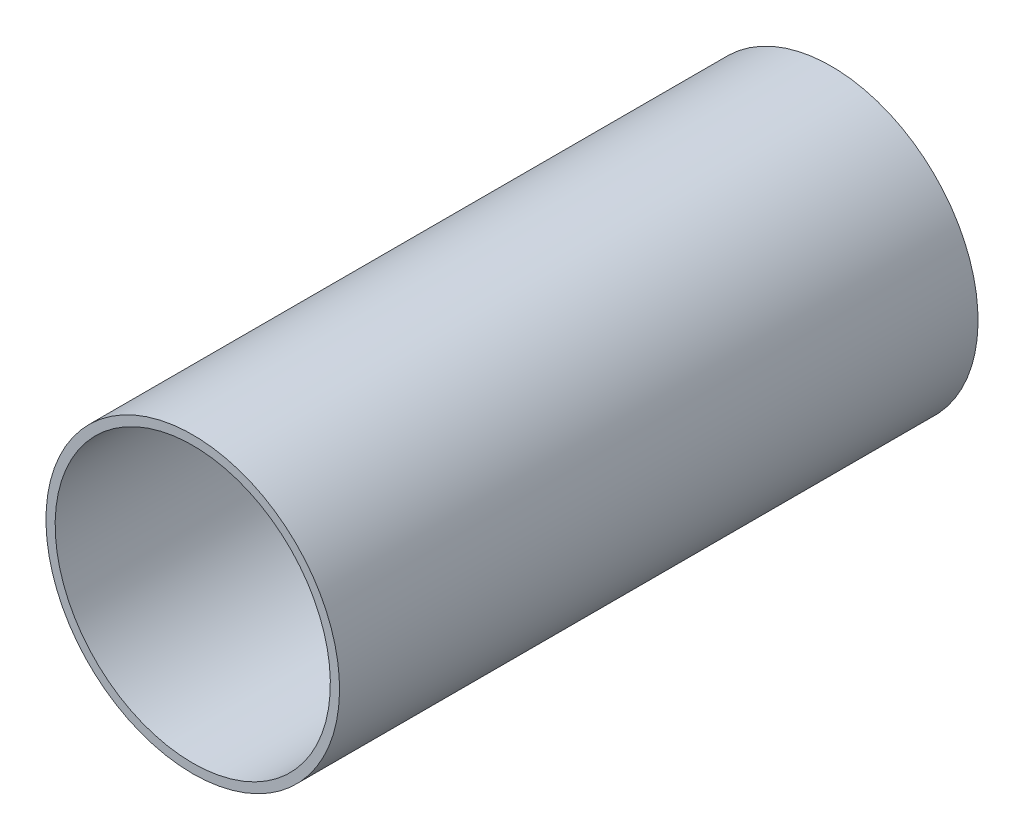
ISO-10303-21;
HEADER;
FILE_DESCRIPTION(('STEP AP214'),'2;1');
FILE_NAME('part.step','',(''),(''),'','','');
FILE_SCHEMA(('AUTOMOTIVE_DESIGN { 1 0 10303 214 1 1 1 1 }'));
ENDSEC;
DATA;
#1=APPLICATION_CONTEXT('core data for automotive mechanical design processes');
#2=APPLICATION_PROTOCOL_DEFINITION('international standard','automotive_design',2000,#1);
#3=PRODUCT_CONTEXT('',#1,'mechanical');
#4=PRODUCT('Part','Part','',(#3));
#5=PRODUCT_RELATED_PRODUCT_CATEGORY('part','',(#4));
#6=PRODUCT_DEFINITION_FORMATION('','',#4);
#7=PRODUCT_DEFINITION_CONTEXT('part definition',#1,'design');
#8=PRODUCT_DEFINITION('design','',#6,#7);
#9=PRODUCT_DEFINITION_SHAPE('','',#8);
#10=(LENGTH_UNIT() NAMED_UNIT(*) SI_UNIT(.MILLI.,.METRE.));
#11=(NAMED_UNIT(*) PLANE_ANGLE_UNIT() SI_UNIT($,.RADIAN.));
#12=(NAMED_UNIT(*) SI_UNIT($,.STERADIAN.) SOLID_ANGLE_UNIT());
#13=UNCERTAINTY_MEASURE_WITH_UNIT(LENGTH_MEASURE(1.E-05),#10,'distance_accuracy_value','');
#14=(GEOMETRIC_REPRESENTATION_CONTEXT(3) GLOBAL_UNCERTAINTY_ASSIGNED_CONTEXT((#13)) GLOBAL_UNIT_ASSIGNED_CONTEXT((#10,
#11,#12)) REPRESENTATION_CONTEXT('',''));
#15=CARTESIAN_POINT('',(0.,0.,0.));
#16=DIRECTION('',(0.,0.,1.));
#17=DIRECTION('',(1.,0.,0.));
#18=AXIS2_PLACEMENT_3D('',#15,#16,#17);
#19=CARTESIAN_POINT('',(170.18,-110.236,-0.045));
#20=DIRECTION('',(0.,0.,-1.));
#21=DIRECTION('',(0.,-1.,0.));
#22=AXIS2_PLACEMENT_3D('',#19,#20,#21);
#23=CYLINDRICAL_SURFACE('',#22,0.375);
#24=CARTESIAN_POINT('',(170.18,-110.236,-0.035));
#25=DIRECTION('',(0.,0.,-1.));
#26=DIRECTION('',(0.,-1.,0.));
#27=AXIS2_PLACEMENT_3D('',#24,#25,#26);
#28=CIRCLE('',#27,0.375);
#29=CARTESIAN_POINT('',(170.18,-110.611,-0.035));
#30=VERTEX_POINT('',#29);
#31=EDGE_CURVE('E64',#30,#30,#28,.T.);
#32=ORIENTED_EDGE('',*,*,#31,.T.);
#33=DIRECTION('',(0.,0.,1.));
#34=VECTOR('',#33,1.);
#35=CARTESIAN_POINT('',(170.18,-110.611,-0.045));
#36=LINE('',#35,#34);
#37=CARTESIAN_POINT('',(170.18,-110.611,1.705));
#38=VERTEX_POINT('',#37);
#39=EDGE_CURVE('E11',#30,#38,#36,.T.);
#40=ORIENTED_EDGE('',*,*,#39,.T.);
#41=CARTESIAN_POINT('',(170.18,-110.236,1.705));
#42=DIRECTION('',(0.,0.,-1.));
#43=DIRECTION('',(0.,-1.,0.));
#44=AXIS2_PLACEMENT_3D('',#41,#42,#43);
#45=CIRCLE('',#44,0.375);
#46=EDGE_CURVE('E25',#38,#38,#45,.T.);
#47=ORIENTED_EDGE('',*,*,#46,.F.);
#48=ORIENTED_EDGE('',*,*,#39,.F.);
#49=EDGE_LOOP('',(#32,#40,#47,#48));
#50=FACE_BOUND('',#49,.T.);
#51=ADVANCED_FACE('F17',(#50),#23,.F.);
#52=CARTESIAN_POINT('',(170.18,-110.636,1.705));
#53=DIRECTION('',(0.,0.,1.));
#54=DIRECTION('',(1.,0.,0.));
#55=AXIS2_PLACEMENT_3D('',#52,#53,#54);
#56=PLANE('',#55);
#57=ORIENTED_EDGE('',*,*,#46,.T.);
#58=EDGE_LOOP('',(#57));
#59=FACE_BOUND('',#58,.T.);
#60=CARTESIAN_POINT('',(170.18,-110.236,1.705));
#61=DIRECTION('',(0.,0.,1.));
#62=DIRECTION('',(0.,-1.,0.));
#63=AXIS2_PLACEMENT_3D('',#60,#61,#62);
#64=CIRCLE('',#63,0.4);
#65=CARTESIAN_POINT('',(170.18,-110.636,1.705));
#66=VERTEX_POINT('',#65);
#67=EDGE_CURVE('E56',#66,#66,#64,.T.);
#68=ORIENTED_EDGE('',*,*,#67,.T.);
#69=EDGE_LOOP('',(#68));
#70=FACE_BOUND('',#69,.T.);
#71=ADVANCED_FACE('F73',(#59,#70),#56,.T.);
#72=CARTESIAN_POINT('',(170.18,-110.636,-0.035));
#73=DIRECTION('',(0.,0.,1.));
#74=DIRECTION('',(1.,0.,0.));
#75=AXIS2_PLACEMENT_3D('',#72,#73,#74);
#76=PLANE('',#75);
#77=ORIENTED_EDGE('',*,*,#31,.F.);
#78=EDGE_LOOP('',(#77));
#79=FACE_BOUND('',#78,.T.);
#80=CARTESIAN_POINT('',(170.18,-110.236,-0.035));
#81=DIRECTION('',(0.,0.,1.));
#82=DIRECTION('',(0.,-1.,0.));
#83=AXIS2_PLACEMENT_3D('',#80,#81,#82);
#84=CIRCLE('',#83,0.4);
#85=CARTESIAN_POINT('',(170.18,-110.636,-0.035));
#86=VERTEX_POINT('',#85);
#87=EDGE_CURVE('E55',#86,#86,#84,.T.);
#88=ORIENTED_EDGE('',*,*,#87,.F.);
#89=EDGE_LOOP('',(#88));
#90=FACE_BOUND('',#89,.T.);
#91=ADVANCED_FACE('F82',(#79,#90),#76,.F.);
#92=CARTESIAN_POINT('',(170.18,-110.236,-0.035));
#93=DIRECTION('',(0.,0.,-1.));
#94=DIRECTION('',(0.,-1.,0.));
#95=AXIS2_PLACEMENT_3D('',#92,#93,#94);
#96=CYLINDRICAL_SURFACE('',#95,0.4);
#97=ORIENTED_EDGE('',*,*,#87,.T.);
#98=DIRECTION('',(0.,0.,1.));
#99=VECTOR('',#98,1.);
#100=CARTESIAN_POINT('',(170.18,-110.636,-0.035));
#101=LINE('',#100,#99);
#102=EDGE_CURVE('E52',#86,#66,#101,.T.);
#103=ORIENTED_EDGE('',*,*,#102,.T.);
#104=ORIENTED_EDGE('',*,*,#67,.F.);
#105=ORIENTED_EDGE('',*,*,#102,.F.);
#106=EDGE_LOOP('',(#97,#103,#104,#105));
#107=FACE_BOUND('',#106,.T.);
#108=ADVANCED_FACE('F53',(#107),#96,.T.);
#109=CLOSED_SHELL('',(#51,#71,#91,#108));
#110=MANIFOLD_SOLID_BREP('B1',#109);
#111=ADVANCED_BREP_SHAPE_REPRESENTATION('',(#18,#110),#14);
#112=SHAPE_DEFINITION_REPRESENTATION(#9,#111);
ENDSEC;
END-ISO-10303-21;
